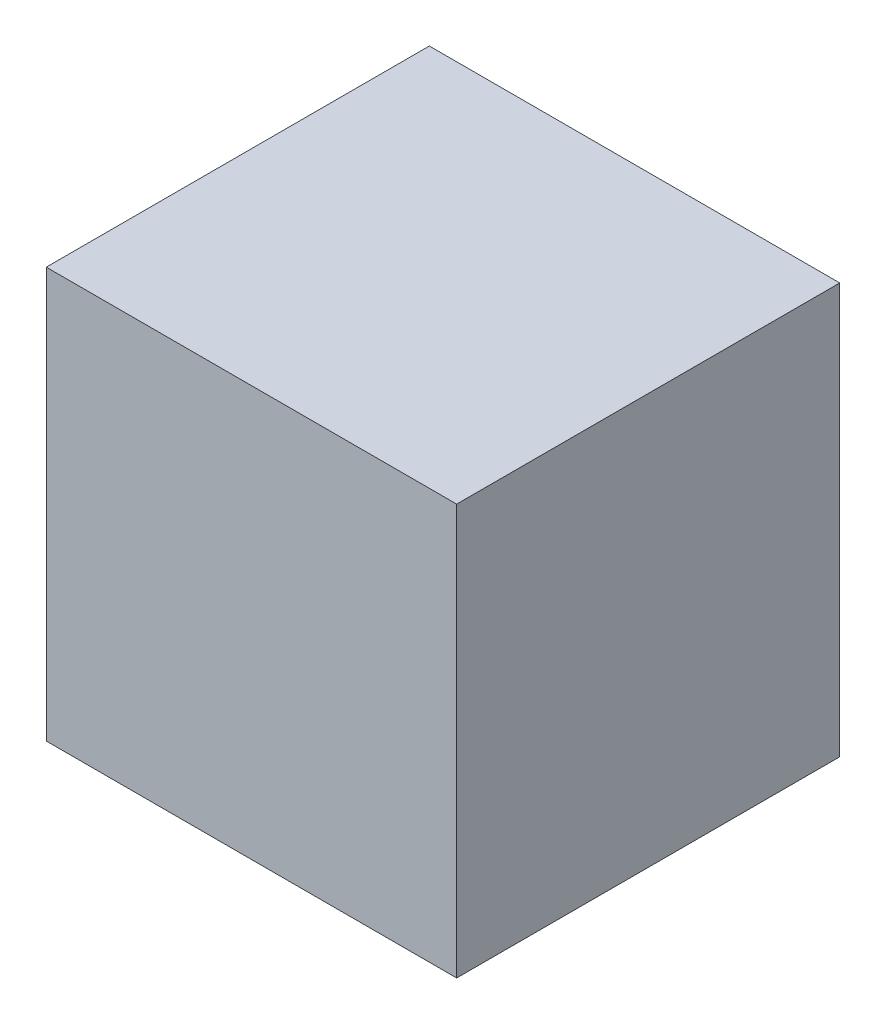
ISO-10303-21;
HEADER;
FILE_DESCRIPTION(('STEP AP214'),'2;1');
FILE_NAME('part.step','',(''),(''),'','','');
FILE_SCHEMA(('AUTOMOTIVE_DESIGN { 1 0 10303 214 1 1 1 1 }'));
ENDSEC;
DATA;
#1=APPLICATION_CONTEXT('core data for automotive mechanical design processes');
#2=APPLICATION_PROTOCOL_DEFINITION('international standard','automotive_design',2000,#1);
#3=PRODUCT_CONTEXT('',#1,'mechanical');
#4=PRODUCT('Part','Part','',(#3));
#5=PRODUCT_RELATED_PRODUCT_CATEGORY('part','',(#4));
#6=PRODUCT_DEFINITION_FORMATION('','',#4);
#7=PRODUCT_DEFINITION_CONTEXT('part definition',#1,'design');
#8=PRODUCT_DEFINITION('design','',#6,#7);
#9=PRODUCT_DEFINITION_SHAPE('','',#8);
#10=(LENGTH_UNIT() NAMED_UNIT(*) SI_UNIT(.MILLI.,.METRE.));
#11=(NAMED_UNIT(*) PLANE_ANGLE_UNIT() SI_UNIT($,.RADIAN.));
#12=(NAMED_UNIT(*) SI_UNIT($,.STERADIAN.) SOLID_ANGLE_UNIT());
#13=UNCERTAINTY_MEASURE_WITH_UNIT(LENGTH_MEASURE(1.E-05),#10,'distance_accuracy_value','');
#14=(GEOMETRIC_REPRESENTATION_CONTEXT(3) GLOBAL_UNCERTAINTY_ASSIGNED_CONTEXT((#13)) GLOBAL_UNIT_ASSIGNED_CONTEXT((#10,
#11,#12)) REPRESENTATION_CONTEXT('',''));
#15=CARTESIAN_POINT('',(0.,0.,0.));
#16=DIRECTION('',(0.,0.,1.));
#17=DIRECTION('',(1.,0.,0.));
#18=AXIS2_PLACEMENT_3D('',#15,#16,#17);
#19=CARTESIAN_POINT('',(-0.2999994,0.2999994,0.55999888));
#20=DIRECTION('',(0.,0.,-1.));
#21=DIRECTION('',(-1.,0.,0.));
#22=AXIS2_PLACEMENT_3D('',#19,#20,#21);
#23=PLANE('',#22);
#24=DIRECTION('',(1.,0.,0.));
#25=VECTOR('',#24,1.);
#26=CARTESIAN_POINT('',(-0.2999994,-0.2999994,0.55999888));
#27=LINE('',#26,#25);
#28=CARTESIAN_POINT('',(-0.2999994,-0.2999994,0.55999888));
#29=VERTEX_POINT('',#28);
#30=CARTESIAN_POINT('',(0.30000194,-0.2999994,0.55999888));
#31=VERTEX_POINT('',#30);
#32=EDGE_CURVE('E55',#29,#31,#27,.T.);
#33=ORIENTED_EDGE('',*,*,#32,.T.);
#34=DIRECTION('',(0.,1.,0.));
#35=VECTOR('',#34,1.);
#36=CARTESIAN_POINT('',(0.30000194,-0.2999994,0.55999888));
#37=LINE('',#36,#35);
#38=CARTESIAN_POINT('',(0.30000194,0.2999994,0.55999888));
#39=VERTEX_POINT('',#38);
#40=EDGE_CURVE('E57',#31,#39,#37,.T.);
#41=ORIENTED_EDGE('',*,*,#40,.T.);
#42=DIRECTION('',(1.,0.,0.));
#43=VECTOR('',#42,1.);
#44=CARTESIAN_POINT('',(0.30000194,0.2999994,0.55999888));
#45=LINE('',#44,#43);
#46=CARTESIAN_POINT('',(-0.2999994,0.2999994,0.55999888));
#47=VERTEX_POINT('',#46);
#48=EDGE_CURVE('E20',#39,#47,#45,.F.);
#49=ORIENTED_EDGE('',*,*,#48,.T.);
#50=DIRECTION('',(0.,1.,0.));
#51=VECTOR('',#50,1.);
#52=CARTESIAN_POINT('',(-0.2999994,0.2999994,0.55999888));
#53=LINE('',#52,#51);
#54=EDGE_CURVE('E80',#47,#29,#53,.F.);
#55=ORIENTED_EDGE('',*,*,#54,.T.);
#56=EDGE_LOOP('',(#33,#41,#49,#55));
#57=FACE_BOUND('',#56,.T.);
#58=ADVANCED_FACE('F17',(#57),#23,.F.);
#59=CARTESIAN_POINT('',(0.30000194,0.2999994,0.));
#60=DIRECTION('',(0.,-1.,0.));
#61=DIRECTION('',(0.,0.,-1.));
#62=AXIS2_PLACEMENT_3D('',#59,#60,#61);
#63=PLANE('',#62);
#64=DIRECTION('',(0.,0.,-1.));
#65=VECTOR('',#64,1.);
#66=CARTESIAN_POINT('',(-0.2999994,0.2999994,0.));
#67=LINE('',#66,#65);
#68=CARTESIAN_POINT('',(-0.2999994,0.2999994,0.));
#69=VERTEX_POINT('',#68);
#70=EDGE_CURVE('E68',#69,#47,#67,.F.);
#71=ORIENTED_EDGE('',*,*,#70,.T.);
#72=ORIENTED_EDGE('',*,*,#48,.F.);
#73=DIRECTION('',(0.,0.,1.));
#74=VECTOR('',#73,1.);
#75=CARTESIAN_POINT('',(0.30000194,0.2999994,0.));
#76=LINE('',#75,#74);
#77=CARTESIAN_POINT('',(0.30000194,0.2999994,0.));
#78=VERTEX_POINT('',#77);
#79=EDGE_CURVE('E63',#39,#78,#76,.F.);
#80=ORIENTED_EDGE('',*,*,#79,.T.);
#81=DIRECTION('',(-1.,0.,0.));
#82=VECTOR('',#81,1.);
#83=CARTESIAN_POINT('',(-0.2999994,0.2999994,0.));
#84=LINE('',#83,#82);
#85=EDGE_CURVE('E83',#69,#78,#84,.F.);
#86=ORIENTED_EDGE('',*,*,#85,.F.);
#87=EDGE_LOOP('',(#71,#72,#80,#86));
#88=FACE_BOUND('',#87,.T.);
#89=ADVANCED_FACE('F65',(#88),#63,.F.);
#90=CARTESIAN_POINT('',(0.30000194,-0.2999994,0.));
#91=DIRECTION('',(-1.,0.,0.));
#92=DIRECTION('',(0.,0.,1.));
#93=AXIS2_PLACEMENT_3D('',#90,#91,#92);
#94=PLANE('',#93);
#95=ORIENTED_EDGE('',*,*,#79,.F.);
#96=ORIENTED_EDGE('',*,*,#40,.F.);
#97=DIRECTION('',(0.,0.,1.));
#98=VECTOR('',#97,1.);
#99=CARTESIAN_POINT('',(0.30000194,-0.2999994,0.));
#100=LINE('',#99,#98);
#101=CARTESIAN_POINT('',(0.30000194,-0.2999994,0.));
#102=VERTEX_POINT('',#101);
#103=EDGE_CURVE('E75',#31,#102,#100,.F.);
#104=ORIENTED_EDGE('',*,*,#103,.T.);
#105=DIRECTION('',(0.,1.,0.));
#106=VECTOR('',#105,1.);
#107=CARTESIAN_POINT('',(0.30000194,0.2999994,0.));
#108=LINE('',#107,#106);
#109=EDGE_CURVE('E72',#78,#102,#108,.F.);
#110=ORIENTED_EDGE('',*,*,#109,.F.);
#111=EDGE_LOOP('',(#95,#96,#104,#110));
#112=FACE_BOUND('',#111,.T.);
#113=ADVANCED_FACE('F70',(#112),#94,.F.);
#114=CARTESIAN_POINT('',(-0.2999994,-0.2999994,0.));
#115=DIRECTION('',(0.,1.,0.));
#116=DIRECTION('',(0.,0.,1.));
#117=AXIS2_PLACEMENT_3D('',#114,#115,#116);
#118=PLANE('',#117);
#119=ORIENTED_EDGE('',*,*,#103,.F.);
#120=ORIENTED_EDGE('',*,*,#32,.F.);
#121=DIRECTION('',(0.,0.,-1.));
#122=VECTOR('',#121,1.);
#123=CARTESIAN_POINT('',(-0.2999994,-0.2999994,0.));
#124=LINE('',#123,#122);
#125=CARTESIAN_POINT('',(-0.2999994,-0.2999994,0.));
#126=VERTEX_POINT('',#125);
#127=EDGE_CURVE('E35',#29,#126,#124,.T.);
#128=ORIENTED_EDGE('',*,*,#127,.T.);
#129=DIRECTION('',(-1.,0.,0.));
#130=VECTOR('',#129,1.);
#131=CARTESIAN_POINT('',(-0.2999994,-0.2999994,0.));
#132=LINE('',#131,#130);
#133=EDGE_CURVE('E26',#102,#126,#132,.T.);
#134=ORIENTED_EDGE('',*,*,#133,.F.);
#135=EDGE_LOOP('',(#119,#120,#128,#134));
#136=FACE_BOUND('',#135,.T.);
#137=ADVANCED_FACE('F89',(#136),#118,.F.);
#138=CARTESIAN_POINT('',(-0.2999994,0.2999994,0.));
#139=DIRECTION('',(1.,0.,0.));
#140=DIRECTION('',(0.,0.,-1.));
#141=AXIS2_PLACEMENT_3D('',#138,#139,#140);
#142=PLANE('',#141);
#143=ORIENTED_EDGE('',*,*,#127,.F.);
#144=ORIENTED_EDGE('',*,*,#54,.F.);
#145=ORIENTED_EDGE('',*,*,#70,.F.);
#146=DIRECTION('',(0.,1.,0.));
#147=VECTOR('',#146,1.);
#148=CARTESIAN_POINT('',(-0.2999994,0.2999994,0.));
#149=LINE('',#148,#147);
#150=EDGE_CURVE('E11',#126,#69,#149,.T.);
#151=ORIENTED_EDGE('',*,*,#150,.F.);
#152=EDGE_LOOP('',(#143,#144,#145,#151));
#153=FACE_BOUND('',#152,.T.);
#154=ADVANCED_FACE('F91',(#153),#142,.F.);
#155=CARTESIAN_POINT('',(-0.2999994,0.2999994,0.));
#156=DIRECTION('',(0.,0.,-1.));
#157=DIRECTION('',(-1.,0.,0.));
#158=AXIS2_PLACEMENT_3D('',#155,#156,#157);
#159=PLANE('',#158);
#160=ORIENTED_EDGE('',*,*,#133,.T.);
#161=ORIENTED_EDGE('',*,*,#150,.T.);
#162=ORIENTED_EDGE('',*,*,#85,.T.);
#163=ORIENTED_EDGE('',*,*,#109,.T.);
#164=EDGE_LOOP('',(#160,#161,#162,#163));
#165=FACE_BOUND('',#164,.T.);
#166=ADVANCED_FACE('F88',(#165),#159,.T.);
#167=CLOSED_SHELL('',(#58,#89,#113,#137,#154,#166));
#168=MANIFOLD_SOLID_BREP('B1',#167);
#169=ADVANCED_BREP_SHAPE_REPRESENTATION('',(#18,#168),#14);
#170=SHAPE_DEFINITION_REPRESENTATION(#9,#169);
ENDSEC;
END-ISO-10303-21;
